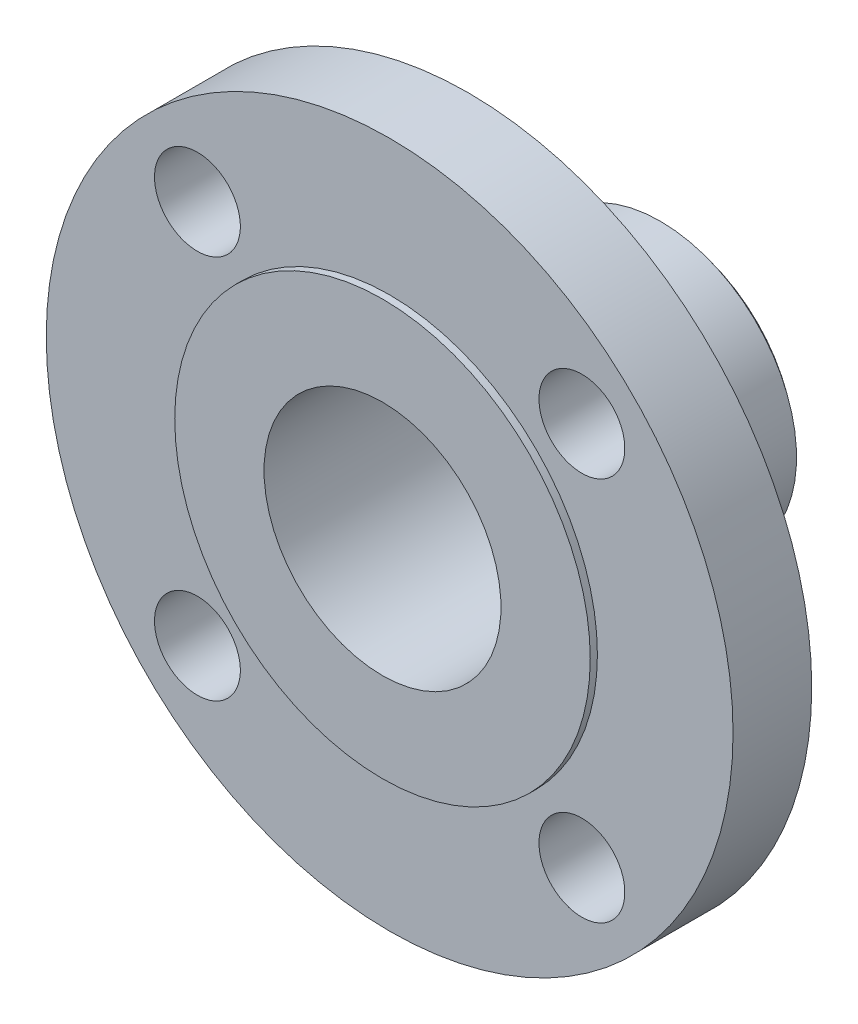
ISO-10303-21;
HEADER;
FILE_DESCRIPTION(('STEP AP214'),'2;1');
FILE_NAME('part.step','',(''),(''),'','','');
FILE_SCHEMA(('AUTOMOTIVE_DESIGN { 1 0 10303 214 1 1 1 1 }'));
ENDSEC;
DATA;
#1=APPLICATION_CONTEXT('core data for automotive mechanical design processes');
#2=APPLICATION_PROTOCOL_DEFINITION('international standard','automotive_design',2000,#1);
#3=PRODUCT_CONTEXT('',#1,'mechanical');
#4=PRODUCT('Part','Part','',(#3));
#5=PRODUCT_RELATED_PRODUCT_CATEGORY('part','',(#4));
#6=PRODUCT_DEFINITION_FORMATION('','',#4);
#7=PRODUCT_DEFINITION_CONTEXT('part definition',#1,'design');
#8=PRODUCT_DEFINITION('design','',#6,#7);
#9=PRODUCT_DEFINITION_SHAPE('','',#8);
#10=(LENGTH_UNIT() NAMED_UNIT(*) SI_UNIT(.MILLI.,.METRE.));
#11=(NAMED_UNIT(*) PLANE_ANGLE_UNIT() SI_UNIT($,.RADIAN.));
#12=(NAMED_UNIT(*) SI_UNIT($,.STERADIAN.) SOLID_ANGLE_UNIT());
#13=UNCERTAINTY_MEASURE_WITH_UNIT(LENGTH_MEASURE(1.E-05),#10,'distance_accuracy_value','');
#14=(GEOMETRIC_REPRESENTATION_CONTEXT(3) GLOBAL_UNCERTAINTY_ASSIGNED_CONTEXT((#13)) GLOBAL_UNIT_ASSIGNED_CONTEXT((#10,
#11,#12)) REPRESENTATION_CONTEXT('',''));
#15=CARTESIAN_POINT('',(0.,0.,0.));
#16=DIRECTION('',(0.,0.,1.));
#17=DIRECTION('',(1.,0.,0.));
#18=AXIS2_PLACEMENT_3D('',#15,#16,#17);
#19=CARTESIAN_POINT('',(0.,15.113,-63.5));
#20=DIRECTION('',(0.,0.,-1.));
#21=DIRECTION('',(0.,1.,0.));
#22=AXIS2_PLACEMENT_3D('',#19,#20,#21);
#23=PLANE('',#22);
#24=CARTESIAN_POINT('',(0.,0.,-63.5));
#25=DIRECTION('',(0.,0.,1.));
#26=DIRECTION('',(0.,1.,0.));
#27=AXIS2_PLACEMENT_3D('',#24,#25,#26);
#28=CIRCLE('',#27,26.289);
#29=CARTESIAN_POINT('',(0.,26.289,-63.5));
#30=VERTEX_POINT('',#29);
#31=EDGE_CURVE('E95',#30,#30,#28,.T.);
#32=ORIENTED_EDGE('',*,*,#31,.T.);
#33=EDGE_LOOP('',(#32));
#34=FACE_BOUND('',#33,.T.);
#35=CARTESIAN_POINT('',(0.,0.,-63.5));
#36=DIRECTION('',(0.,0.,-1.));
#37=DIRECTION('',(0.,1.,0.));
#38=AXIS2_PLACEMENT_3D('',#35,#36,#37);
#39=CIRCLE('',#38,27.813);
#40=CARTESIAN_POINT('',(0.,27.813,-63.5));
#41=VERTEX_POINT('',#40);
#42=EDGE_CURVE('E87',#41,#41,#39,.T.);
#43=ORIENTED_EDGE('',*,*,#42,.T.);
#44=EDGE_LOOP('',(#43));
#45=FACE_BOUND('',#44,.T.);
#46=ADVANCED_FACE('F16',(#34,#45),#23,.T.);
#47=CARTESIAN_POINT('',(0.,0.,-57.1092606779735));
#48=DIRECTION('',(0.,0.,1.));
#49=DIRECTION('',(0.,1.,0.));
#50=AXIS2_PLACEMENT_3D('',#47,#48,#49);
#51=CYLINDRICAL_SURFACE('',#50,30.226);
#52=CARTESIAN_POINT('',(0.,0.,-50.7185213559471));
#53=DIRECTION('',(0.,0.,-1.));
#54=DIRECTION('',(0.,1.,0.));
#55=AXIS2_PLACEMENT_3D('',#52,#53,#54);
#56=CIRCLE('',#55,30.226);
#57=CARTESIAN_POINT('',(0.,30.226,-50.7185213559471));
#58=VERTEX_POINT('',#57);
#59=EDGE_CURVE('E11',#58,#58,#56,.T.);
#60=ORIENTED_EDGE('',*,*,#59,.T.);
#61=EDGE_LOOP('',(#60));
#62=FACE_BOUND('',#61,.T.);
#63=CARTESIAN_POINT('',(0.,0.,-61.6484399780068));
#64=DIRECTION('',(0.,0.,1.));
#65=DIRECTION('',(0.,1.,0.));
#66=AXIS2_PLACEMENT_3D('',#63,#64,#65);
#67=CIRCLE('',#66,30.226);
#68=CARTESIAN_POINT('',(0.,30.226,-61.6484399780068));
#69=VERTEX_POINT('',#68);
#70=EDGE_CURVE('E126',#69,#69,#67,.T.);
#71=ORIENTED_EDGE('',*,*,#70,.T.);
#72=EDGE_LOOP('',(#71));
#73=FACE_BOUND('',#72,.T.);
#74=ADVANCED_FACE('F169',(#62,#73),#51,.T.);
#75=CARTESIAN_POINT('',(0.,0.,-50.718521355947));
#76=DIRECTION('',(0.,0.,-1.));
#77=DIRECTION('',(0.,1.,0.));
#78=AXIS2_PLACEMENT_3D('',#75,#76,#77);
#79=TOROIDAL_SURFACE('',#78,34.29,4.06399999999979);
#80=CARTESIAN_POINT('',(0.,0.,-49.6316410832453));
#81=DIRECTION('',(0.,0.,-1.));
#82=DIRECTION('',(0.,1.,0.));
#83=AXIS2_PLACEMENT_3D('',#80,#81,#82);
#84=CIRCLE('',#83,30.374034311589);
#85=CARTESIAN_POINT('',(0.,30.3740343115891,-49.6316410832453));
#86=VERTEX_POINT('',#85);
#87=EDGE_CURVE('E26',#86,#86,#84,.T.);
#88=ORIENTED_EDGE('',*,*,#87,.T.);
#89=EDGE_LOOP('',(#88));
#90=FACE_BOUND('',#89,.T.);
#91=ORIENTED_EDGE('',*,*,#59,.F.);
#92=EDGE_LOOP('',(#91));
#93=FACE_BOUND('',#92,.T.);
#94=ADVANCED_FACE('F174',(#90,#93),#79,.F.);
#95=CARTESIAN_POINT('',(0.,0.,-34.3408205416226));
#96=DIRECTION('',(0.,0.,1.));
#97=DIRECTION('',(0.,1.,0.));
#98=AXIS2_PLACEMENT_3D('',#95,#96,#97);
#99=CONICAL_SURFACE('',#98,34.6180171557946,0.270736324025741);
#100=CARTESIAN_POINT('',(0.,0.,-19.05));
#101=DIRECTION('',(0.,0.,-1.));
#102=DIRECTION('',(0.,1.,0.));
#103=AXIS2_PLACEMENT_3D('',#100,#101,#102);
#104=CIRCLE('',#103,38.862);
#105=CARTESIAN_POINT('',(0.,38.862,-19.05));
#106=VERTEX_POINT('',#105);
#107=EDGE_CURVE('E111',#106,#106,#104,.T.);
#108=ORIENTED_EDGE('',*,*,#107,.T.);
#109=EDGE_LOOP('',(#108));
#110=FACE_BOUND('',#109,.T.);
#111=ORIENTED_EDGE('',*,*,#87,.F.);
#112=EDGE_LOOP('',(#111));
#113=FACE_BOUND('',#112,.T.);
#114=ADVANCED_FACE('F179',(#110,#113),#99,.T.);
#115=CARTESIAN_POINT('',(0.,57.531,-19.05));
#116=DIRECTION('',(0.,0.,-1.));
#117=DIRECTION('',(0.,1.,0.));
#118=AXIS2_PLACEMENT_3D('',#115,#116,#117);
#119=PLANE('',#118);
#120=CARTESIAN_POINT('',(0.,0.,-19.05));
#121=DIRECTION('',(0.,0.,-1.));
#122=DIRECTION('',(0.,1.,0.));
#123=AXIS2_PLACEMENT_3D('',#120,#121,#122);
#124=CIRCLE('',#123,76.2);
#125=CARTESIAN_POINT('',(0.,76.2,-19.05));
#126=VERTEX_POINT('',#125);
#127=EDGE_CURVE('E113',#126,#126,#124,.T.);
#128=ORIENTED_EDGE('',*,*,#127,.T.);
#129=EDGE_LOOP('',(#128));
#130=FACE_BOUND('',#129,.T.);
#131=ORIENTED_EDGE('',*,*,#107,.F.);
#132=EDGE_LOOP('',(#131));
#133=FACE_BOUND('',#132,.T.);
#134=CARTESIAN_POINT('',(-42.6562165750785,42.6562165750785,-19.05));
#135=DIRECTION('',(0.,0.,1.));
#136=DIRECTION('',(0.707106781186548,0.707106781186547,0.));
#137=AXIS2_PLACEMENT_3D('',#134,#135,#136);
#138=CIRCLE('',#137,9.525);
#139=CARTESIAN_POINT('',(-35.9210244842766,49.3914086658803,-19.05));
#140=VERTEX_POINT('',#139);
#141=EDGE_CURVE('E108',#140,#140,#138,.T.);
#142=ORIENTED_EDGE('',*,*,#141,.T.);
#143=EDGE_LOOP('',(#142));
#144=FACE_BOUND('',#143,.T.);
#145=CARTESIAN_POINT('',(-42.6562165750785,-42.6562165750785,-19.05));
#146=DIRECTION('',(0.,0.,1.));
#147=DIRECTION('',(-0.707106781186548,0.707106781186548,0.));
#148=AXIS2_PLACEMENT_3D('',#145,#146,#147);
#149=CIRCLE('',#148,9.525);
#150=CARTESIAN_POINT('',(-49.3914086658804,-35.9210244842766,-19.05));
#151=VERTEX_POINT('',#150);
#152=EDGE_CURVE('E110',#151,#151,#149,.T.);
#153=ORIENTED_EDGE('',*,*,#152,.T.);
#154=EDGE_LOOP('',(#153));
#155=FACE_BOUND('',#154,.T.);
#156=CARTESIAN_POINT('',(42.6562165750784,-42.6562165750785,-19.05));
#157=DIRECTION('',(0.,0.,1.));
#158=DIRECTION('',(-0.707106781186548,-0.707106781186547,0.));
#159=AXIS2_PLACEMENT_3D('',#156,#157,#158);
#160=CIRCLE('',#159,9.525);
#161=CARTESIAN_POINT('',(35.9210244842766,-49.3914086658804,-19.05));
#162=VERTEX_POINT('',#161);
#163=EDGE_CURVE('E55',#162,#162,#160,.T.);
#164=ORIENTED_EDGE('',*,*,#163,.T.);
#165=EDGE_LOOP('',(#164));
#166=FACE_BOUND('',#165,.T.);
#167=CARTESIAN_POINT('',(42.6562165750785,42.6562165750784,-19.05));
#168=DIRECTION('',(0.,0.,1.));
#169=DIRECTION('',(0.707106781186548,-0.707106781186548,0.));
#170=AXIS2_PLACEMENT_3D('',#167,#168,#169);
#171=CIRCLE('',#170,9.525);
#172=CARTESIAN_POINT('',(49.3914086658804,35.9210244842766,-19.05));
#173=VERTEX_POINT('',#172);
#174=EDGE_CURVE('E20',#173,#173,#171,.T.);
#175=ORIENTED_EDGE('',*,*,#174,.T.);
#176=EDGE_LOOP('',(#175));
#177=FACE_BOUND('',#176,.T.);
#178=ADVANCED_FACE('F132',(#130,#133,#144,#155,#166,#177),#119,.T.);
#179=CARTESIAN_POINT('',(0.,0.,-10.31875));
#180=DIRECTION('',(0.,0.,1.));
#181=DIRECTION('',(0.,1.,0.));
#182=AXIS2_PLACEMENT_3D('',#179,#180,#181);
#183=CYLINDRICAL_SURFACE('',#182,76.2);
#184=CARTESIAN_POINT('',(0.,0.,-1.5875));
#185=DIRECTION('',(0.,0.,-1.));
#186=DIRECTION('',(0.,1.,0.));
#187=AXIS2_PLACEMENT_3D('',#184,#185,#186);
#188=CIRCLE('',#187,76.2);
#189=CARTESIAN_POINT('',(0.,76.2,-1.5875));
#190=VERTEX_POINT('',#189);
#191=EDGE_CURVE('E103',#190,#190,#188,.T.);
#192=ORIENTED_EDGE('',*,*,#191,.T.);
#193=EDGE_LOOP('',(#192));
#194=FACE_BOUND('',#193,.T.);
#195=ORIENTED_EDGE('',*,*,#127,.F.);
#196=EDGE_LOOP('',(#195));
#197=FACE_BOUND('',#196,.T.);
#198=ADVANCED_FACE('F145',(#194,#197),#183,.T.);
#199=CARTESIAN_POINT('',(0.,61.1505,-1.5875));
#200=DIRECTION('',(0.,0.,1.));
#201=DIRECTION('',(0.,-1.,0.));
#202=AXIS2_PLACEMENT_3D('',#199,#200,#201);
#203=PLANE('',#202);
#204=CARTESIAN_POINT('',(0.,0.,-1.5875));
#205=DIRECTION('',(0.,0.,-1.));
#206=DIRECTION('',(0.,1.,0.));
#207=AXIS2_PLACEMENT_3D('',#204,#205,#206);
#208=CIRCLE('',#207,46.101);
#209=CARTESIAN_POINT('',(0.,46.101,-1.5875));
#210=VERTEX_POINT('',#209);
#211=EDGE_CURVE('E107',#210,#210,#208,.T.);
#212=ORIENTED_EDGE('',*,*,#211,.T.);
#213=EDGE_LOOP('',(#212));
#214=FACE_BOUND('',#213,.T.);
#215=ORIENTED_EDGE('',*,*,#191,.F.);
#216=EDGE_LOOP('',(#215));
#217=FACE_BOUND('',#216,.T.);
#218=CARTESIAN_POINT('',(-42.6562165750785,42.6562165750785,-1.5875));
#219=DIRECTION('',(0.,0.,-1.));
#220=DIRECTION('',(0.707106781186548,0.707106781186547,0.));
#221=AXIS2_PLACEMENT_3D('',#218,#219,#220);
#222=CIRCLE('',#221,9.525);
#223=CARTESIAN_POINT('',(-49.3914086658803,35.9210244842766,-1.5875));
#224=VERTEX_POINT('',#223);
#225=EDGE_CURVE('E128',#224,#224,#222,.T.);
#226=ORIENTED_EDGE('',*,*,#225,.T.);
#227=EDGE_LOOP('',(#226));
#228=FACE_BOUND('',#227,.T.);
#229=CARTESIAN_POINT('',(-42.6562165750785,-42.6562165750785,-1.5875));
#230=DIRECTION('',(0.,0.,-1.));
#231=DIRECTION('',(-0.707106781186548,0.707106781186548,0.));
#232=AXIS2_PLACEMENT_3D('',#229,#230,#231);
#233=CIRCLE('',#232,9.525);
#234=CARTESIAN_POINT('',(-35.9210244842766,-49.3914086658803,-1.5875));
#235=VERTEX_POINT('',#234);
#236=EDGE_CURVE('E47',#235,#235,#233,.T.);
#237=ORIENTED_EDGE('',*,*,#236,.T.);
#238=EDGE_LOOP('',(#237));
#239=FACE_BOUND('',#238,.T.);
#240=CARTESIAN_POINT('',(42.6562165750784,-42.6562165750785,-1.5875));
#241=DIRECTION('',(0.,0.,-1.));
#242=DIRECTION('',(-0.707106781186548,-0.707106781186547,0.));
#243=AXIS2_PLACEMENT_3D('',#240,#241,#242);
#244=CIRCLE('',#243,9.525);
#245=CARTESIAN_POINT('',(49.3914086658803,-35.9210244842766,-1.5875));
#246=VERTEX_POINT('',#245);
#247=EDGE_CURVE('E116',#246,#246,#244,.T.);
#248=ORIENTED_EDGE('',*,*,#247,.T.);
#249=EDGE_LOOP('',(#248));
#250=FACE_BOUND('',#249,.T.);
#251=CARTESIAN_POINT('',(42.6562165750785,42.6562165750784,-1.5875));
#252=DIRECTION('',(0.,0.,-1.));
#253=DIRECTION('',(0.707106781186548,-0.707106781186548,0.));
#254=AXIS2_PLACEMENT_3D('',#251,#252,#253);
#255=CIRCLE('',#254,9.525);
#256=CARTESIAN_POINT('',(35.9210244842766,49.3914086658803,-1.5875));
#257=VERTEX_POINT('',#256);
#258=EDGE_CURVE('E97',#257,#257,#255,.T.);
#259=ORIENTED_EDGE('',*,*,#258,.T.);
#260=EDGE_LOOP('',(#259));
#261=FACE_BOUND('',#260,.T.);
#262=ADVANCED_FACE('F143',(#214,#217,#228,#239,#250,#261),#203,.T.);
#263=CARTESIAN_POINT('',(0.,0.,-0.79375));
#264=DIRECTION('',(0.,0.,1.));
#265=DIRECTION('',(0.,1.,0.));
#266=AXIS2_PLACEMENT_3D('',#263,#264,#265);
#267=CYLINDRICAL_SURFACE('',#266,46.101);
#268=CARTESIAN_POINT('',(0.,0.,0.));
#269=DIRECTION('',(0.,0.,-1.));
#270=DIRECTION('',(0.,1.,0.));
#271=AXIS2_PLACEMENT_3D('',#268,#269,#270);
#272=CIRCLE('',#271,46.101);
#273=CARTESIAN_POINT('',(0.,46.101,0.));
#274=VERTEX_POINT('',#273);
#275=EDGE_CURVE('E105',#274,#274,#272,.T.);
#276=ORIENTED_EDGE('',*,*,#275,.T.);
#277=EDGE_LOOP('',(#276));
#278=FACE_BOUND('',#277,.T.);
#279=ORIENTED_EDGE('',*,*,#211,.F.);
#280=EDGE_LOOP('',(#279));
#281=FACE_BOUND('',#280,.T.);
#282=ADVANCED_FACE('F18',(#278,#281),#267,.T.);
#283=CARTESIAN_POINT('',(0.,23.0505,0.));
#284=DIRECTION('',(0.,0.,1.));
#285=DIRECTION('',(0.,-1.,0.));
#286=AXIS2_PLACEMENT_3D('',#283,#284,#285);
#287=PLANE('',#286);
#288=ORIENTED_EDGE('',*,*,#275,.F.);
#289=EDGE_LOOP('',(#288));
#290=FACE_BOUND('',#289,.T.);
#291=CARTESIAN_POINT('',(0.,0.,0.));
#292=DIRECTION('',(0.,0.,-1.));
#293=DIRECTION('',(0.,1.,0.));
#294=AXIS2_PLACEMENT_3D('',#291,#292,#293);
#295=CIRCLE('',#294,26.289);
#296=CARTESIAN_POINT('',(0.,26.289,0.));
#297=VERTEX_POINT('',#296);
#298=EDGE_CURVE('E91',#297,#297,#295,.T.);
#299=ORIENTED_EDGE('',*,*,#298,.T.);
#300=EDGE_LOOP('',(#299));
#301=FACE_BOUND('',#300,.T.);
#302=ADVANCED_FACE('F139',(#290,#301),#287,.T.);
#303=CARTESIAN_POINT('',(-42.6562165750785,42.6562165750785,-9.525));
#304=DIRECTION('',(0.,0.,1.));
#305=DIRECTION('',(0.707106781186548,0.707106781186547,0.));
#306=AXIS2_PLACEMENT_3D('',#303,#304,#305);
#307=CYLINDRICAL_SURFACE('',#306,9.525);
#308=ORIENTED_EDGE('',*,*,#141,.F.);
#309=EDGE_LOOP('',(#308));
#310=FACE_BOUND('',#309,.T.);
#311=ORIENTED_EDGE('',*,*,#225,.F.);
#312=EDGE_LOOP('',(#311));
#313=FACE_BOUND('',#312,.T.);
#314=ADVANCED_FACE('F135',(#310,#313),#307,.F.);
#315=CARTESIAN_POINT('',(-42.6562165750785,-42.6562165750785,-9.525));
#316=DIRECTION('',(0.,0.,1.));
#317=DIRECTION('',(-0.707106781186548,0.707106781186548,0.));
#318=AXIS2_PLACEMENT_3D('',#315,#316,#317);
#319=CYLINDRICAL_SURFACE('',#318,9.525);
#320=ORIENTED_EDGE('',*,*,#152,.F.);
#321=EDGE_LOOP('',(#320));
#322=FACE_BOUND('',#321,.T.);
#323=ORIENTED_EDGE('',*,*,#236,.F.);
#324=EDGE_LOOP('',(#323));
#325=FACE_BOUND('',#324,.T.);
#326=ADVANCED_FACE('F138',(#322,#325),#319,.F.);
#327=CARTESIAN_POINT('',(42.6562165750784,-42.6562165750785,-9.525));
#328=DIRECTION('',(0.,0.,1.));
#329=DIRECTION('',(-0.707106781186548,-0.707106781186547,0.));
#330=AXIS2_PLACEMENT_3D('',#327,#328,#329);
#331=CYLINDRICAL_SURFACE('',#330,9.525);
#332=ORIENTED_EDGE('',*,*,#163,.F.);
#333=EDGE_LOOP('',(#332));
#334=FACE_BOUND('',#333,.T.);
#335=ORIENTED_EDGE('',*,*,#247,.F.);
#336=EDGE_LOOP('',(#335));
#337=FACE_BOUND('',#336,.T.);
#338=ADVANCED_FACE('F155',(#334,#337),#331,.F.);
#339=CARTESIAN_POINT('',(42.6562165750785,42.6562165750784,-9.525));
#340=DIRECTION('',(0.,0.,1.));
#341=DIRECTION('',(0.707106781186548,-0.707106781186548,0.));
#342=AXIS2_PLACEMENT_3D('',#339,#340,#341);
#343=CYLINDRICAL_SURFACE('',#342,9.525);
#344=ORIENTED_EDGE('',*,*,#174,.F.);
#345=EDGE_LOOP('',(#344));
#346=FACE_BOUND('',#345,.T.);
#347=ORIENTED_EDGE('',*,*,#258,.F.);
#348=EDGE_LOOP('',(#347));
#349=FACE_BOUND('',#348,.T.);
#350=ADVANCED_FACE('F152',(#346,#349),#343,.F.);
#351=CARTESIAN_POINT('',(0.,0.,-31.75));
#352=DIRECTION('',(0.,0.,-1.));
#353=DIRECTION('',(0.,1.,0.));
#354=AXIS2_PLACEMENT_3D('',#351,#352,#353);
#355=CYLINDRICAL_SURFACE('',#354,26.289);
#356=ORIENTED_EDGE('',*,*,#31,.F.);
#357=EDGE_LOOP('',(#356));
#358=FACE_BOUND('',#357,.T.);
#359=ORIENTED_EDGE('',*,*,#298,.F.);
#360=EDGE_LOOP('',(#359));
#361=FACE_BOUND('',#360,.T.);
#362=ADVANCED_FACE('F154',(#358,#361),#355,.F.);
#363=CARTESIAN_POINT('',(0.,0.,-62.5742199890034));
#364=DIRECTION('',(0.,0.,1.));
#365=DIRECTION('',(0.,1.,0.));
#366=AXIS2_PLACEMENT_3D('',#363,#364,#365);
#367=CONICAL_SURFACE('',#366,29.0195,0.916297857297023);
#368=ORIENTED_EDGE('',*,*,#42,.F.);
#369=EDGE_LOOP('',(#368));
#370=FACE_BOUND('',#369,.T.);
#371=ORIENTED_EDGE('',*,*,#70,.F.);
#372=EDGE_LOOP('',(#371));
#373=FACE_BOUND('',#372,.T.);
#374=ADVANCED_FACE('F163',(#370,#373),#367,.T.);
#375=CLOSED_SHELL('',(#46,#74,#94,#114,#178,#198,#262,#282,#302,#314,#326,#338,#350,#362,#374));
#376=MANIFOLD_SOLID_BREP('B1',#375);
#377=ADVANCED_BREP_SHAPE_REPRESENTATION('',(#18,#376),#14);
#378=SHAPE_DEFINITION_REPRESENTATION(#9,#377);
ENDSEC;
END-ISO-10303-21;
